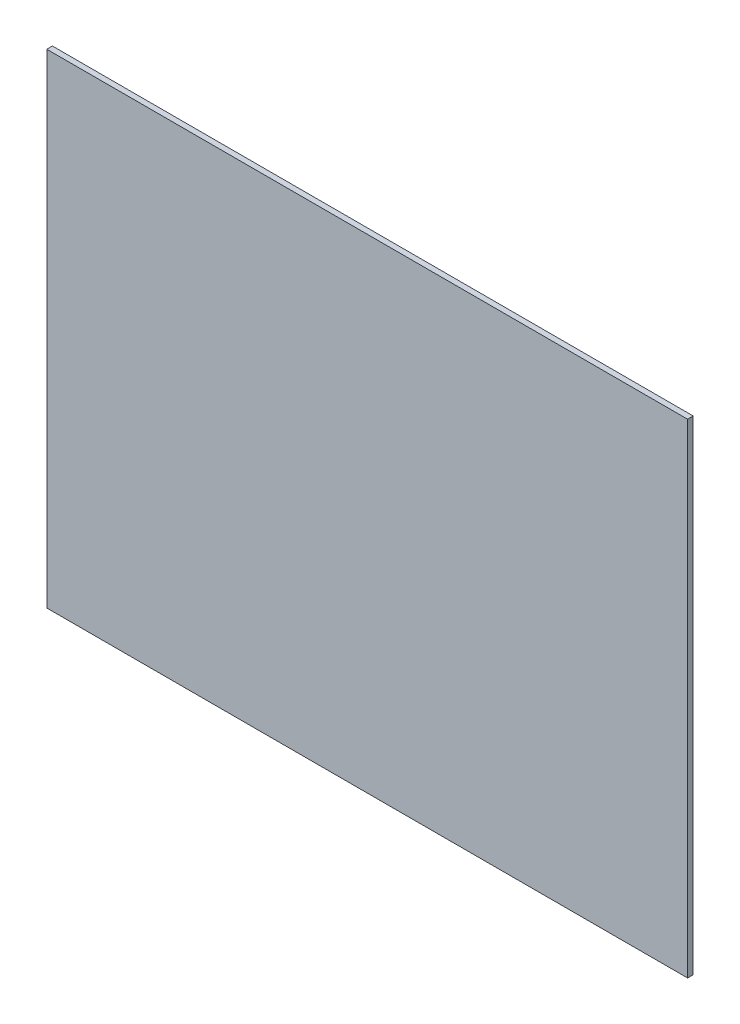
ISO-10303-21;
HEADER;
FILE_DESCRIPTION(('STEP AP214'),'2;1');
FILE_NAME('part.step','',(''),(''),'','','');
FILE_SCHEMA(('AUTOMOTIVE_DESIGN { 1 0 10303 214 1 1 1 1 }'));
ENDSEC;
DATA;
#1=APPLICATION_CONTEXT('core data for automotive mechanical design processes');
#2=APPLICATION_PROTOCOL_DEFINITION('international standard','automotive_design',2000,#1);
#3=PRODUCT_CONTEXT('',#1,'mechanical');
#4=PRODUCT('Part','Part','',(#3));
#5=PRODUCT_RELATED_PRODUCT_CATEGORY('part','',(#4));
#6=PRODUCT_DEFINITION_FORMATION('','',#4);
#7=PRODUCT_DEFINITION_CONTEXT('part definition',#1,'design');
#8=PRODUCT_DEFINITION('design','',#6,#7);
#9=PRODUCT_DEFINITION_SHAPE('','',#8);
#10=(LENGTH_UNIT() NAMED_UNIT(*) SI_UNIT(.MILLI.,.METRE.));
#11=(NAMED_UNIT(*) PLANE_ANGLE_UNIT() SI_UNIT($,.RADIAN.));
#12=(NAMED_UNIT(*) SI_UNIT($,.STERADIAN.) SOLID_ANGLE_UNIT());
#13=UNCERTAINTY_MEASURE_WITH_UNIT(LENGTH_MEASURE(1.E-05),#10,'distance_accuracy_value','');
#14=(GEOMETRIC_REPRESENTATION_CONTEXT(3) GLOBAL_UNCERTAINTY_ASSIGNED_CONTEXT((#13)) GLOBAL_UNIT_ASSIGNED_CONTEXT((#10,
#11,#12)) REPRESENTATION_CONTEXT('',''));
#15=CARTESIAN_POINT('',(0.,0.,0.));
#16=DIRECTION('',(0.,0.,1.));
#17=DIRECTION('',(1.,0.,0.));
#18=AXIS2_PLACEMENT_3D('',#15,#16,#17);
#19=CARTESIAN_POINT('',(304.8,230.1875,5.334));
#20=DIRECTION('',(-1.,0.,0.));
#21=DIRECTION('',(0.,-1.,0.));
#22=AXIS2_PLACEMENT_3D('',#19,#20,#21);
#23=PLANE('',#22);
#24=DIRECTION('',(0.,1.,0.));
#25=VECTOR('',#24,1.);
#26=CARTESIAN_POINT('',(304.8,230.1875,0.));
#27=LINE('',#26,#25);
#28=CARTESIAN_POINT('',(304.8,-230.1875,0.));
#29=VERTEX_POINT('',#28);
#30=CARTESIAN_POINT('',(304.8,230.1875,0.));
#31=VERTEX_POINT('',#30);
#32=EDGE_CURVE('E96',#29,#31,#27,.T.);
#33=ORIENTED_EDGE('',*,*,#32,.T.);
#34=DIRECTION('',(0.,0.,-1.));
#35=VECTOR('',#34,1.);
#36=CARTESIAN_POINT('',(304.8,230.1875,5.334));
#37=LINE('',#36,#35);
#38=CARTESIAN_POINT('',(304.8,230.1875,5.334));
#39=VERTEX_POINT('',#38);
#40=EDGE_CURVE('E11',#39,#31,#37,.T.);
#41=ORIENTED_EDGE('',*,*,#40,.F.);
#42=DIRECTION('',(0.,1.,0.));
#43=VECTOR('',#42,1.);
#44=CARTESIAN_POINT('',(304.8,230.1875,5.334));
#45=LINE('',#44,#43);
#46=CARTESIAN_POINT('',(304.8,-230.1875,5.334));
#47=VERTEX_POINT('',#46);
#48=EDGE_CURVE('E84',#47,#39,#45,.T.);
#49=ORIENTED_EDGE('',*,*,#48,.F.);
#50=DIRECTION('',(0.,0.,-1.));
#51=VECTOR('',#50,1.);
#52=CARTESIAN_POINT('',(304.8,-230.1875,5.334));
#53=LINE('',#52,#51);
#54=EDGE_CURVE('E92',#47,#29,#53,.T.);
#55=ORIENTED_EDGE('',*,*,#54,.T.);
#56=EDGE_LOOP('',(#33,#41,#49,#55));
#57=FACE_BOUND('',#56,.T.);
#58=ADVANCED_FACE('F33',(#57),#23,.F.);
#59=CARTESIAN_POINT('',(-304.8,230.1875,5.334));
#60=DIRECTION('',(0.,-1.,0.));
#61=DIRECTION('',(0.,0.,-1.));
#62=AXIS2_PLACEMENT_3D('',#59,#60,#61);
#63=PLANE('',#62);
#64=DIRECTION('',(-1.,0.,0.));
#65=VECTOR('',#64,1.);
#66=CARTESIAN_POINT('',(-304.8,230.1875,0.));
#67=LINE('',#66,#65);
#68=CARTESIAN_POINT('',(-304.8,230.1875,0.));
#69=VERTEX_POINT('',#68);
#70=EDGE_CURVE('E88',#31,#69,#67,.T.);
#71=ORIENTED_EDGE('',*,*,#70,.T.);
#72=DIRECTION('',(0.,0.,-1.));
#73=VECTOR('',#72,1.);
#74=CARTESIAN_POINT('',(-304.8,230.1875,5.334));
#75=LINE('',#74,#73);
#76=CARTESIAN_POINT('',(-304.8,230.1875,5.334));
#77=VERTEX_POINT('',#76);
#78=EDGE_CURVE('E41',#77,#69,#75,.T.);
#79=ORIENTED_EDGE('',*,*,#78,.F.);
#80=DIRECTION('',(-1.,0.,0.));
#81=VECTOR('',#80,1.);
#82=CARTESIAN_POINT('',(-304.8,230.1875,5.334));
#83=LINE('',#82,#81);
#84=EDGE_CURVE('E79',#39,#77,#83,.T.);
#85=ORIENTED_EDGE('',*,*,#84,.F.);
#86=ORIENTED_EDGE('',*,*,#40,.T.);
#87=EDGE_LOOP('',(#71,#79,#85,#86));
#88=FACE_BOUND('',#87,.T.);
#89=ADVANCED_FACE('F87',(#88),#63,.F.);
#90=CARTESIAN_POINT('',(-304.8,230.1875,5.334));
#91=DIRECTION('',(1.,0.,0.));
#92=DIRECTION('',(0.,1.,0.));
#93=AXIS2_PLACEMENT_3D('',#90,#91,#92);
#94=PLANE('',#93);
#95=DIRECTION('',(0.,-1.,0.));
#96=VECTOR('',#95,1.);
#97=CARTESIAN_POINT('',(-304.8,230.1875,0.));
#98=LINE('',#97,#96);
#99=CARTESIAN_POINT('',(-304.8,-230.1875,0.));
#100=VERTEX_POINT('',#99);
#101=EDGE_CURVE('E66',#69,#100,#98,.T.);
#102=ORIENTED_EDGE('',*,*,#101,.T.);
#103=DIRECTION('',(0.,0.,-1.));
#104=VECTOR('',#103,1.);
#105=CARTESIAN_POINT('',(-304.8,-230.1875,5.334));
#106=LINE('',#105,#104);
#107=CARTESIAN_POINT('',(-304.8,-230.1875,5.334));
#108=VERTEX_POINT('',#107);
#109=EDGE_CURVE('E89',#108,#100,#106,.T.);
#110=ORIENTED_EDGE('',*,*,#109,.F.);
#111=DIRECTION('',(0.,-1.,0.));
#112=VECTOR('',#111,1.);
#113=CARTESIAN_POINT('',(-304.8,230.1875,5.334));
#114=LINE('',#113,#112);
#115=EDGE_CURVE('E82',#77,#108,#114,.T.);
#116=ORIENTED_EDGE('',*,*,#115,.F.);
#117=ORIENTED_EDGE('',*,*,#78,.T.);
#118=EDGE_LOOP('',(#102,#110,#116,#117));
#119=FACE_BOUND('',#118,.T.);
#120=ADVANCED_FACE('F90',(#119),#94,.F.);
#121=CARTESIAN_POINT('',(-304.8,-230.1875,5.334));
#122=DIRECTION('',(0.,1.,0.));
#123=DIRECTION('',(0.,0.,1.));
#124=AXIS2_PLACEMENT_3D('',#121,#122,#123);
#125=PLANE('',#124);
#126=DIRECTION('',(1.,0.,0.));
#127=VECTOR('',#126,1.);
#128=CARTESIAN_POINT('',(-304.8,-230.1875,0.));
#129=LINE('',#128,#127);
#130=EDGE_CURVE('E72',#100,#29,#129,.T.);
#131=ORIENTED_EDGE('',*,*,#130,.T.);
#132=ORIENTED_EDGE('',*,*,#54,.F.);
#133=DIRECTION('',(1.,0.,0.));
#134=VECTOR('',#133,1.);
#135=CARTESIAN_POINT('',(-304.8,-230.1875,5.334));
#136=LINE('',#135,#134);
#137=EDGE_CURVE('E49',#108,#47,#136,.T.);
#138=ORIENTED_EDGE('',*,*,#137,.F.);
#139=ORIENTED_EDGE('',*,*,#109,.T.);
#140=EDGE_LOOP('',(#131,#132,#138,#139));
#141=FACE_BOUND('',#140,.T.);
#142=ADVANCED_FACE('F103',(#141),#125,.F.);
#143=CARTESIAN_POINT('',(0.,0.,5.334));
#144=DIRECTION('',(0.,0.,1.));
#145=DIRECTION('',(1.,0.,0.));
#146=AXIS2_PLACEMENT_3D('',#143,#144,#145);
#147=PLANE('',#146);
#148=ORIENTED_EDGE('',*,*,#48,.T.);
#149=ORIENTED_EDGE('',*,*,#84,.T.);
#150=ORIENTED_EDGE('',*,*,#115,.T.);
#151=ORIENTED_EDGE('',*,*,#137,.T.);
#152=EDGE_LOOP('',(#148,#149,#150,#151));
#153=FACE_BOUND('',#152,.T.);
#154=ADVANCED_FACE('F80',(#153),#147,.T.);
#155=CARTESIAN_POINT('',(0.,0.,0.));
#156=DIRECTION('',(0.,0.,1.));
#157=DIRECTION('',(1.,0.,0.));
#158=AXIS2_PLACEMENT_3D('',#155,#156,#157);
#159=PLANE('',#158);
#160=ORIENTED_EDGE('',*,*,#32,.F.);
#161=ORIENTED_EDGE('',*,*,#130,.F.);
#162=ORIENTED_EDGE('',*,*,#101,.F.);
#163=ORIENTED_EDGE('',*,*,#70,.F.);
#164=EDGE_LOOP('',(#160,#161,#162,#163));
#165=FACE_BOUND('',#164,.T.);
#166=ADVANCED_FACE('F106',(#165),#159,.F.);
#167=CLOSED_SHELL('',(#58,#89,#120,#142,#154,#166));
#168=MANIFOLD_SOLID_BREP('B2',#167);
#169=ADVANCED_BREP_SHAPE_REPRESENTATION('',(#18,#168),#14);
#170=SHAPE_DEFINITION_REPRESENTATION(#9,#169);
ENDSEC;
END-ISO-10303-21;
